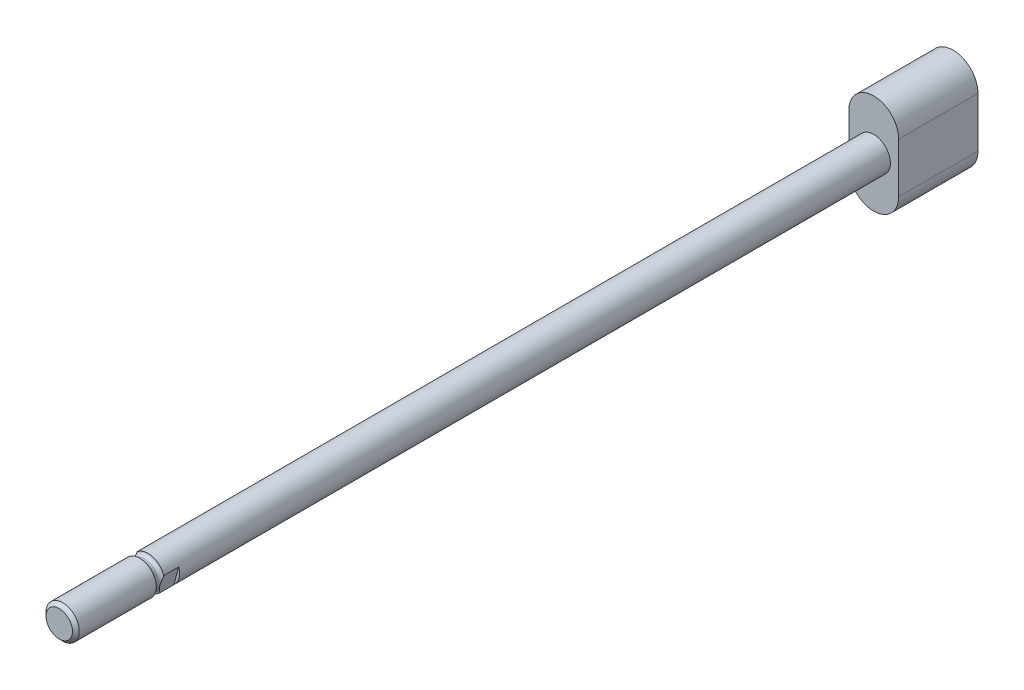
ISO-10303-21;
HEADER;
FILE_DESCRIPTION(('STEP AP214'),'2;1');
FILE_NAME('part.step','',(''),(''),'','','');
FILE_SCHEMA(('AUTOMOTIVE_DESIGN { 1 0 10303 214 1 1 1 1 }'));
ENDSEC;
DATA;
#1=APPLICATION_CONTEXT('core data for automotive mechanical design processes');
#2=APPLICATION_PROTOCOL_DEFINITION('international standard','automotive_design',2000,#1);
#3=PRODUCT_CONTEXT('',#1,'mechanical');
#4=PRODUCT('Part','Part','',(#3));
#5=PRODUCT_RELATED_PRODUCT_CATEGORY('part','',(#4));
#6=PRODUCT_DEFINITION_FORMATION('','',#4);
#7=PRODUCT_DEFINITION_CONTEXT('part definition',#1,'design');
#8=PRODUCT_DEFINITION('design','',#6,#7);
#9=PRODUCT_DEFINITION_SHAPE('','',#8);
#10=(LENGTH_UNIT() NAMED_UNIT(*) SI_UNIT(.MILLI.,.METRE.));
#11=(NAMED_UNIT(*) PLANE_ANGLE_UNIT() SI_UNIT($,.RADIAN.));
#12=(NAMED_UNIT(*) SI_UNIT($,.STERADIAN.) SOLID_ANGLE_UNIT());
#13=UNCERTAINTY_MEASURE_WITH_UNIT(LENGTH_MEASURE(1.E-05),#10,'distance_accuracy_value','');
#14=(GEOMETRIC_REPRESENTATION_CONTEXT(3) GLOBAL_UNCERTAINTY_ASSIGNED_CONTEXT((#13)) GLOBAL_UNIT_ASSIGNED_CONTEXT((#10,
#11,#12)) REPRESENTATION_CONTEXT('',''));
#15=CARTESIAN_POINT('',(0.,0.,0.));
#16=DIRECTION('',(0.,0.,1.));
#17=DIRECTION('',(1.,0.,0.));
#18=AXIS2_PLACEMENT_3D('',#15,#16,#17);
#19=CARTESIAN_POINT('',(0.,0.,6.5));
#20=DIRECTION('',(0.,0.,-1.));
#21=DIRECTION('',(-1.,0.,0.));
#22=AXIS2_PLACEMENT_3D('',#19,#20,#21);
#23=CYLINDRICAL_SURFACE('',#22,3.);
#24=CARTESIAN_POINT('',(0.,0.,-123.85));
#25=DIRECTION('',(0.,0.,1.));
#26=DIRECTION('',(1.,0.,0.));
#27=AXIS2_PLACEMENT_3D('',#24,#25,#26);
#28=CIRCLE('',#27,3.);
#29=CARTESIAN_POINT('',(3.,0.,-123.85));
#30=VERTEX_POINT('',#29);
#31=EDGE_CURVE('E11',#30,#30,#28,.F.);
#32=ORIENTED_EDGE('',*,*,#31,.F.);
#33=EDGE_LOOP('',(#32));
#34=FACE_BOUND('',#33,.T.);
#35=CARTESIAN_POINT('',(0.,0.,4.3));
#36=DIRECTION('',(0.,0.,1.));
#37=DIRECTION('',(1.,0.,0.));
#38=AXIS2_PLACEMENT_3D('',#35,#36,#37);
#39=CIRCLE('',#38,3.);
#40=CARTESIAN_POINT('',(-2.84401739632425,-0.954759157801097,4.3));
#41=VERTEX_POINT('',#40);
#42=CARTESIAN_POINT('',(-1.9856117351211,2.24885438331373,4.3));
#43=VERTEX_POINT('',#42);
#44=EDGE_CURVE('E50',#41,#43,#39,.F.);
#45=ORIENTED_EDGE('',*,*,#44,.T.);
#46=DIRECTION('',(0.,0.,-1.));
#47=VECTOR('',#46,1.);
#48=CARTESIAN_POINT('',(-1.9856117351211,2.24885438331373,6.5));
#49=LINE('',#48,#47);
#50=CARTESIAN_POINT('',(-1.98561173512109,2.24885438331375,6.99999999999974));
#51=VERTEX_POINT('',#50);
#52=EDGE_CURVE('E158',#43,#51,#49,.F.);
#53=ORIENTED_EDGE('',*,*,#52,.T.);
#54=CARTESIAN_POINT('',(0.,0.,7.));
#55=DIRECTION('',(0.,0.,-1.));
#56=DIRECTION('',(-1.,0.,0.));
#57=AXIS2_PLACEMENT_3D('',#54,#55,#56);
#58=CIRCLE('',#57,3.);
#59=CARTESIAN_POINT('',(2.84401739632423,0.954759157801142,7.));
#60=VERTEX_POINT('',#59);
#61=EDGE_CURVE('E181',#51,#60,#58,.T.);
#62=ORIENTED_EDGE('',*,*,#61,.T.);
#63=DIRECTION('',(0.,0.,-1.));
#64=VECTOR('',#63,1.);
#65=CARTESIAN_POINT('',(2.84401739632423,0.954759157801142,6.5));
#66=LINE('',#65,#64);
#67=CARTESIAN_POINT('',(2.84401739632423,0.954759157801142,4.3));
#68=VERTEX_POINT('',#67);
#69=EDGE_CURVE('E65',#60,#68,#66,.T.);
#70=ORIENTED_EDGE('',*,*,#69,.T.);
#71=CARTESIAN_POINT('',(1.98561173512111,-2.24885438331372,4.3));
#72=VERTEX_POINT('',#71);
#73=EDGE_CURVE('E248',#68,#72,#39,.F.);
#74=ORIENTED_EDGE('',*,*,#73,.T.);
#75=DIRECTION('',(0.,0.,-1.));
#76=VECTOR('',#75,1.);
#77=CARTESIAN_POINT('',(1.98561173512111,-2.24885438331372,6.5));
#78=LINE('',#77,#76);
#79=CARTESIAN_POINT('',(1.98561173512111,-2.24885438331374,6.99999999999974));
#80=VERTEX_POINT('',#79);
#81=EDGE_CURVE('E162',#72,#80,#78,.F.);
#82=ORIENTED_EDGE('',*,*,#81,.T.);
#83=CARTESIAN_POINT('',(-2.84401739632425,-0.954759157801097,7.));
#84=VERTEX_POINT('',#83);
#85=EDGE_CURVE('E180',#80,#84,#58,.T.);
#86=ORIENTED_EDGE('',*,*,#85,.T.);
#87=DIRECTION('',(0.,0.,-1.));
#88=VECTOR('',#87,1.);
#89=CARTESIAN_POINT('',(-2.84401739632425,-0.954759157801095,6.5));
#90=LINE('',#89,#88);
#91=EDGE_CURVE('E57',#84,#41,#90,.T.);
#92=ORIENTED_EDGE('',*,*,#91,.T.);
#93=EDGE_LOOP('',(#45,#53,#62,#70,#74,#82,#86,#92));
#94=FACE_BOUND('',#93,.T.);
#95=ADVANCED_FACE('F43',(#34,#94),#23,.T.);
#96=CARTESIAN_POINT('',(0.,0.,7.6000000000001));
#97=DIRECTION('',(0.,0.,-1.));
#98=DIRECTION('',(-1.,0.,0.));
#99=AXIS2_PLACEMENT_3D('',#96,#97,#98);
#100=TOROIDAL_SURFACE('',#99,3.0000000000001,0.600000000000099);
#101=CARTESIAN_POINT('',(0.,0.,7.6));
#102=DIRECTION('',(0.,0.,-1.));
#103=DIRECTION('',(-1.,0.,0.));
#104=AXIS2_PLACEMENT_3D('',#101,#102,#103);
#105=CIRCLE('',#104,2.4);
#106=CARTESIAN_POINT('',(-2.4,0.,7.6));
#107=VERTEX_POINT('',#106);
#108=EDGE_CURVE('E177',#107,#107,#105,.T.);
#109=ORIENTED_EDGE('',*,*,#108,.T.);
#110=EDGE_LOOP('',(#109));
#111=FACE_BOUND('',#110,.T.);
#112=ORIENTED_EDGE('',*,*,#85,.F.);
#113=CARTESIAN_POINT('',(1.78428928389336,-3.0002,7.2547069152957));
#114=CARTESIAN_POINT('',(1.78906861743825,-2.98236328438416,7.23639868329596));
#115=CARTESIAN_POINT('',(1.79413251615115,-2.96346455710323,7.21927102970705));
#116=CARTESIAN_POINT('',(1.80470423901084,-2.92401035026732,7.18733126765002));
#117=CARTESIAN_POINT('',(1.8102106230358,-2.9034602453202,7.17251207456602));
#118=CARTESIAN_POINT('',(1.82709895502079,-2.84043213229713,7.13166613512136));
#119=CARTESIAN_POINT('',(1.8389868639061,-2.79606585234141,7.10875658246275));
#120=CARTESIAN_POINT('',(1.86700003507435,-2.69151927426037,7.06483484183125));
#121=CARTESIAN_POINT('',(1.88336791191989,-2.63043352626078,7.04622090491631));
#122=CARTESIAN_POINT('',(1.91668678076934,-2.50608581486391,7.01871125794661));
#123=CARTESIAN_POINT('',(1.93364021499831,-2.4428147369586,7.00986309884397));
#124=CARTESIAN_POINT('',(1.96609809891719,-2.32168026506718,7.00044288032693));
#125=CARTESIAN_POINT('',(1.98159088358271,-2.26386040554471,6.99917848815538));
#126=CARTESIAN_POINT('',(2.0125568215942,-2.1482939515818,7.00180211925441));
#127=CARTESIAN_POINT('',(2.02802993340006,-2.09054751217113,7.00569592608855));
#128=CARTESIAN_POINT('',(2.05898855462406,-1.9750083648309,7.0175872569702));
#129=CARTESIAN_POINT('',(2.07447317901827,-1.91721895985558,7.02561725698419));
#130=CARTESIAN_POINT('',(2.10529478327747,-1.80219116678946,7.04477779010399));
#131=CARTESIAN_POINT('',(2.12063188303649,-1.74495233124807,7.05590553775458));
#132=CARTESIAN_POINT('',(2.15009821499025,-1.63498248328393,7.07942972049004));
#133=CARTESIAN_POINT('',(2.16423553666569,-1.58222128050823,7.0916789462632));
#134=CARTESIAN_POINT('',(2.19244778806578,-1.47693172488718,7.11722145202707));
#135=CARTESIAN_POINT('',(2.20652270783706,-1.42440340918834,7.13051489266332));
#136=CARTESIAN_POINT('',(2.23468365865931,-1.31930530993022,7.15724864827218));
#137=CARTESIAN_POINT('',(2.24876967794869,-1.26673557026587,7.17068914176345));
#138=CARTESIAN_POINT('',(2.27701024290482,-1.16134034701515,7.19656818876434));
#139=CARTESIAN_POINT('',(2.29116480938259,-1.108514785761,7.20900641475076));
#140=CARTESIAN_POINT('',(2.3193653234073,-1.00326903462121,7.23122524619684));
#141=CARTESIAN_POINT('',(2.33340894290738,-0.950857533124738,7.24104793485401));
#142=CARTESIAN_POINT('',(2.36164303548091,-0.84548646513474,7.25666970996551));
#143=CARTESIAN_POINT('',(2.37583336771721,-0.792527424252576,7.26247234663752));
#144=CARTESIAN_POINT('',(2.40424001913043,-0.686512357905542,7.26871086347242));
#145=CARTESIAN_POINT('',(2.4184559815362,-0.633457663928724,7.26916908288715));
#146=CARTESIAN_POINT('',(2.44683354504169,-0.527551155131197,7.26465345979322));
#147=CARTESIAN_POINT('',(2.46099510857075,-0.474699480526146,7.25967637035201));
#148=CARTESIAN_POINT('',(2.48739818541467,-0.3761618562685,7.24636709096959));
#149=CARTESIAN_POINT('',(2.49965782936129,-0.330408242177005,7.2385337573574));
#150=CARTESIAN_POINT('',(2.52406800176128,-0.239308238558716,7.22070567389674));
#151=CARTESIAN_POINT('',(2.53621852717457,-0.193961860377656,7.21071086402217));
#152=CARTESIAN_POINT('',(2.56050923976332,-0.103307686844385,7.18949400632838));
#153=CARTESIAN_POINT('',(2.57264907231151,-0.0580012149791535,7.17826607926568));
#154=CARTESIAN_POINT('',(2.5969056586589,0.0325255976874803,7.15544014274893));
#155=CARTESIAN_POINT('',(2.6090224108104,0.0777459323395919,7.14384210785039));
#156=CARTESIAN_POINT('',(2.64582554712007,0.215097106925173,7.10911815387095));
#157=CARTESIAN_POINT('',(2.67054444156685,0.307349276907487,7.08648227751513));
#158=CARTESIAN_POINT('',(2.72025529113799,0.492872693194391,7.0470486332687));
#159=CARTESIAN_POINT('',(2.74524636340561,0.586140644632787,7.03023575678776));
#160=CARTESIAN_POINT('',(2.78130197319363,0.720702012259566,7.01323872854939));
#161=CARTESIAN_POINT('',(2.79223656212369,0.761510453706438,7.009029885666));
#162=CARTESIAN_POINT('',(2.81415047339667,0.84329428396974,7.00285204263986));
#163=CARTESIAN_POINT('',(2.82512980999665,0.884269725994254,7.00088382332145));
#164=CARTESIAN_POINT('',(2.85794561003269,1.00673995901979,6.99894375438474));
#165=CARTESIAN_POINT('',(2.87981910718841,1.08837296174415,7.00285056611947));
#166=CARTESIAN_POINT('',(2.91849922075284,1.23272911080915,7.02250369852203));
#167=CARTESIAN_POINT('',(2.93538949848092,1.29576448544427,7.03554081025875));
#168=CARTESIAN_POINT('',(2.96019799488484,1.38835105448312,7.06345946956806));
#169=CARTESIAN_POINT('',(2.9684238706186,1.41905044065824,7.07424318243855));
#170=CARTESIAN_POINT('',(2.98457390926757,1.47932320544041,7.09898773527071));
#171=CARTESIAN_POINT('',(2.99249714702534,1.50889313131285,7.1129575286994));
#172=CARTESIAN_POINT('',(3.0002,1.53764056997752,7.12867199246494));
#173=B_SPLINE_CURVE_WITH_KNOTS('',3,(#113,#114,#115,#116,#117,#118,#119,#120,#121,#122,#123,
#124,#125,#126,#127,#128,#129,#130,#131,#132,#133,#134,#135,#136,#137,#138,#139,#140,#141,#142,
#143,#144,#145,#146,#147,#148,#149,#150,#151,#152,#153,#154,#155,#156,#157,#158,#159,#160,#161,
#162,#163,#164,#165,#166,#167,#168,#169,#170,#171,#172),.UNSPECIFIED.,.F.,.F.,(4,2,2,2,2,2,2,2,
2,2,2,2,2,2,2,2,2,2,2,2,2,2,2,2,2,2,2,2,2,4),(0.,0.0778831402477305,0.155522338474484,
0.308670922530255,0.50543277995489,0.703148528985292,0.882501065774774,1.06205486956866,
1.24304045813448,1.42386382952087,1.59178298003943,1.75972801459498,1.92790656547544,
2.09613985310081,2.26147561567191,2.42666517894951,2.59116401392538,2.75576117062527,
2.89972280701112,3.04368844185216,3.18837300124491,3.33306752906019,3.62748955875383,
3.92114184337195,4.04845767494625,4.17581786064581,4.4286846648712,4.62750090273336,
4.72803228730687,4.82884974252454),.UNSPECIFIED.);
#174=EDGE_CURVE('E191',#80,#60,#173,.T.);
#175=ORIENTED_EDGE('',*,*,#174,.T.);
#176=ORIENTED_EDGE('',*,*,#61,.F.);
#177=CARTESIAN_POINT('',(-1.78428928389338,3.00019999999986,7.25470691529554));
#178=CARTESIAN_POINT('',(-1.78906861743827,2.98236328438402,7.23639868329581));
#179=CARTESIAN_POINT('',(-1.79413251615117,2.96346455710308,7.21927102970691));
#180=CARTESIAN_POINT('',(-1.80470423901086,2.92401035026717,7.18733126764989));
#181=CARTESIAN_POINT('',(-1.81021062303582,2.90346024532004,7.1725120745659));
#182=CARTESIAN_POINT('',(-1.82709895502081,2.84043213229696,7.13166613512125));
#183=CARTESIAN_POINT('',(-1.83898686390612,2.79606585234124,7.10875658246266));
#184=CARTESIAN_POINT('',(-1.86700003507439,2.69151927426017,7.06483484183118));
#185=CARTESIAN_POINT('',(-1.88336791191993,2.63043352626055,7.04622090491625));
#186=CARTESIAN_POINT('',(-1.9166867807694,2.50608581486364,7.01871125794656));
#187=CARTESIAN_POINT('',(-1.93364021499838,2.44281473695831,7.00986309884393));
#188=CARTESIAN_POINT('',(-1.96609809891727,2.32168026506683,7.00044288032692));
#189=CARTESIAN_POINT('',(-1.9815908835828,2.26386040554433,6.99917848815537));
#190=CARTESIAN_POINT('',(-2.01255682159431,2.14829395158135,7.00180211925443));
#191=CARTESIAN_POINT('',(-2.02802993340018,2.09054751217066,7.00569592608859));
#192=CARTESIAN_POINT('',(-2.05898855462419,1.97500836483037,7.01758725697027));
#193=CARTESIAN_POINT('',(-2.07447317901842,1.91721895985501,7.02561725698427));
#194=CARTESIAN_POINT('',(-2.10529478327763,1.80219116678884,7.04477779010411));
#195=CARTESIAN_POINT('',(-2.12063188303666,1.74495233124741,7.05590553775471));
#196=CARTESIAN_POINT('',(-2.15009821499043,1.63498248328324,7.0794297204902));
#197=CARTESIAN_POINT('',(-2.16423553666588,1.58222128050753,7.09167894626337));
#198=CARTESIAN_POINT('',(-2.19244778806598,1.47693172488646,7.11722145202725));
#199=CARTESIAN_POINT('',(-2.20652270783725,1.4244034091876,7.13051489266351));
#200=CARTESIAN_POINT('',(-2.23468365865952,1.31930530992946,7.15724864827237));
#201=CARTESIAN_POINT('',(-2.2487696779489,1.2667355702651,7.17068914176365));
#202=CARTESIAN_POINT('',(-2.27701024290503,1.16134034701436,7.19656818876453));
#203=CARTESIAN_POINT('',(-2.29116480938281,1.10851478576019,7.20900641475094));
#204=CARTESIAN_POINT('',(-2.31936532340753,1.00326903462038,7.231225246197));
#205=CARTESIAN_POINT('',(-2.33340894290761,0.950857533123894,7.24104793485415));
#206=CARTESIAN_POINT('',(-2.36164303548115,0.845486465133866,7.25666970996561));
#207=CARTESIAN_POINT('',(-2.37583336771745,0.792527424251688,7.26247234663759));
#208=CARTESIAN_POINT('',(-2.40424001913068,0.686512357904626,7.26871086347243));
#209=CARTESIAN_POINT('',(-2.41845598153645,0.633457663927794,7.26916908288713));
#210=CARTESIAN_POINT('',(-2.44683354504196,0.527551155130243,7.26465345979313));
#211=CARTESIAN_POINT('',(-2.46099510857102,0.474699480525181,7.25967637035189));
#212=CARTESIAN_POINT('',(-2.48739818541492,0.376161856267579,7.24636709096943));
#213=CARTESIAN_POINT('',(-2.49965782936153,0.330408242176138,7.23853375735723));
#214=CARTESIAN_POINT('',(-2.5240680017615,0.239308238557956,7.22070567389656));
#215=CARTESIAN_POINT('',(-2.53621852717477,0.193961860376949,7.210710864022));
#216=CARTESIAN_POINT('',(-2.5605092397635,0.103307686843784,7.18949400632822));
#217=CARTESIAN_POINT('',(-2.57264907231167,0.0580012149786046,7.17826607926553));
#218=CARTESIAN_POINT('',(-2.59690565865904,-0.032525597687924,7.15544014274881));
#219=CARTESIAN_POINT('',(-2.60902241081052,-0.0777459323399832,7.14384210785028));
#220=CARTESIAN_POINT('',(-2.64582554712015,-0.215097106925404,7.10911815387088));
#221=CARTESIAN_POINT('',(-2.6705444415669,-0.30734927690761,7.08648227751509));
#222=CARTESIAN_POINT('',(-2.72025529113798,-0.492872693194296,7.04704863326872));
#223=CARTESIAN_POINT('',(-2.74524636340558,-0.586140644632584,7.03023575678779));
#224=CARTESIAN_POINT('',(-2.78130197319358,-0.720702012259261,7.01323872854942));
#225=CARTESIAN_POINT('',(-2.79223656212364,-0.761510453706141,7.00902988566602));
#226=CARTESIAN_POINT('',(-2.81415047339662,-0.843294283969462,7.00285204263987));
#227=CARTESIAN_POINT('',(-2.8251298099966,-0.884269725993984,7.00088382332146));
#228=CARTESIAN_POINT('',(-2.85794561003265,-1.00673995901954,6.99894375438474));
#229=CARTESIAN_POINT('',(-2.87981910718838,-1.08837296174393,7.00285056611946));
#230=CARTESIAN_POINT('',(-2.91849922075282,-1.23272911080896,7.022503698522));
#231=CARTESIAN_POINT('',(-2.9353894984809,-1.29576448544409,7.03554081025871));
#232=CARTESIAN_POINT('',(-2.96019799488483,-1.38835105448297,7.06345946956802));
#233=CARTESIAN_POINT('',(-2.96842387061859,-1.41905044065809,7.07424318243851));
#234=CARTESIAN_POINT('',(-2.98457390926757,-1.47932320544028,7.09898773527067));
#235=CARTESIAN_POINT('',(-2.99249714702534,-1.50889313131272,7.11295752869935));
#236=CARTESIAN_POINT('',(-3.0002,-1.5376405699774,7.1286719924649));
#237=B_SPLINE_CURVE_WITH_KNOTS('',3,(#177,#178,#179,#180,#181,#182,#183,#184,#185,#186,#187,
#188,#189,#190,#191,#192,#193,#194,#195,#196,#197,#198,#199,#200,#201,#202,#203,#204,#205,#206,
#207,#208,#209,#210,#211,#212,#213,#214,#215,#216,#217,#218,#219,#220,#221,#222,#223,#224,#225,
#226,#227,#228,#229,#230,#231,#232,#233,#234,#235,#236),.UNSPECIFIED.,.F.,.F.,(4,2,2,2,2,2,2,2,
2,2,2,2,2,2,2,2,2,2,2,2,2,2,2,2,2,2,2,2,2,4),(0.,0.0778831402477294,0.155522338474481,
0.308670922530249,0.505432779954952,0.703148528985421,0.882501065775001,1.06205486956898,
1.2430404581349,1.4238638295214,1.59178298003999,1.75972801459557,1.92790656547607,
2.09613985310148,2.26147561567261,2.42666517895024,2.59116401392616,2.75576117062609,
2.89972280701178,3.04368844185266,3.18837300124524,3.33306752906036,3.62748955875365,
3.92114184337143,4.04845767494576,4.17581786064534,4.4286846648708,4.62750090273299,
4.72803228730652,4.8288497425242),.UNSPECIFIED.);
#238=EDGE_CURVE('E184',#51,#84,#237,.T.);
#239=ORIENTED_EDGE('',*,*,#238,.T.);
#240=EDGE_LOOP('',(#112,#175,#176,#239));
#241=FACE_BOUND('',#240,.T.);
#242=ADVANCED_FACE('F197',(#111,#241),#100,.F.);
#243=CARTESIAN_POINT('',(0.,0.,6.5));
#244=DIRECTION('',(0.,0.,-1.));
#245=DIRECTION('',(-1.,0.,0.));
#246=AXIS2_PLACEMENT_3D('',#243,#244,#245);
#247=CYLINDRICAL_SURFACE('',#246,2.4);
#248=CARTESIAN_POINT('',(0.,0.,7.9));
#249=DIRECTION('',(0.,0.,-1.));
#250=DIRECTION('',(-1.,0.,0.));
#251=AXIS2_PLACEMENT_3D('',#248,#249,#250);
#252=CIRCLE('',#251,2.4);
#253=CARTESIAN_POINT('',(-2.4,0.,7.9));
#254=VERTEX_POINT('',#253);
#255=EDGE_CURVE('E174',#254,#254,#252,.T.);
#256=ORIENTED_EDGE('',*,*,#255,.T.);
#257=EDGE_LOOP('',(#256));
#258=FACE_BOUND('',#257,.T.);
#259=ORIENTED_EDGE('',*,*,#108,.F.);
#260=EDGE_LOOP('',(#259));
#261=FACE_BOUND('',#260,.T.);
#262=ADVANCED_FACE('F229',(#258,#261),#247,.T.);
#263=CARTESIAN_POINT('',(0.,0.,7.8999999999999));
#264=DIRECTION('',(0.,0.,-1.));
#265=DIRECTION('',(-1.,0.,0.));
#266=AXIS2_PLACEMENT_3D('',#263,#264,#265);
#267=TOROIDAL_SURFACE('',#266,3.0000000000001,0.6000000000001);
#268=CARTESIAN_POINT('',(0.,0.,8.5));
#269=DIRECTION('',(0.,0.,-1.));
#270=DIRECTION('',(-1.,0.,0.));
#271=AXIS2_PLACEMENT_3D('',#268,#269,#270);
#272=CIRCLE('',#271,3.);
#273=CARTESIAN_POINT('',(-3.,0.,8.5));
#274=VERTEX_POINT('',#273);
#275=EDGE_CURVE('E171',#274,#274,#272,.T.);
#276=ORIENTED_EDGE('',*,*,#275,.T.);
#277=EDGE_LOOP('',(#276));
#278=FACE_BOUND('',#277,.T.);
#279=ORIENTED_EDGE('',*,*,#255,.F.);
#280=EDGE_LOOP('',(#279));
#281=FACE_BOUND('',#280,.T.);
#282=ADVANCED_FACE('F226',(#278,#281),#267,.F.);
#283=CARTESIAN_POINT('',(0.,0.,6.5));
#284=DIRECTION('',(0.,0.,-1.));
#285=DIRECTION('',(-1.,0.,0.));
#286=AXIS2_PLACEMENT_3D('',#283,#284,#285);
#287=CYLINDRICAL_SURFACE('',#286,3.);
#288=CARTESIAN_POINT('',(0.,0.,22.3865));
#289=DIRECTION('',(0.,0.,-1.));
#290=DIRECTION('',(-1.,0.,0.));
#291=AXIS2_PLACEMENT_3D('',#288,#289,#290);
#292=CIRCLE('',#291,3.);
#293=CARTESIAN_POINT('',(-3.,0.,22.3865));
#294=VERTEX_POINT('',#293);
#295=EDGE_CURVE('E168',#294,#294,#292,.T.);
#296=ORIENTED_EDGE('',*,*,#295,.T.);
#297=EDGE_LOOP('',(#296));
#298=FACE_BOUND('',#297,.T.);
#299=ORIENTED_EDGE('',*,*,#275,.F.);
#300=EDGE_LOOP('',(#299));
#301=FACE_BOUND('',#300,.T.);
#302=ADVANCED_FACE('F222',(#298,#301),#287,.T.);
#303=CARTESIAN_POINT('',(0.,0.,22.3865));
#304=DIRECTION('',(0.,0.,-1.));
#305=DIRECTION('',(-1.,0.,0.));
#306=AXIS2_PLACEMENT_3D('',#303,#304,#305);
#307=CONICAL_SURFACE('',#306,3.,0.785398163397452);
#308=CARTESIAN_POINT('',(0.,0.,23.));
#309=DIRECTION('',(0.,0.,-1.));
#310=DIRECTION('',(-1.,0.,0.));
#311=AXIS2_PLACEMENT_3D('',#308,#309,#310);
#312=CIRCLE('',#311,2.3865);
#313=CARTESIAN_POINT('',(-2.3865,0.,23.));
#314=VERTEX_POINT('',#313);
#315=EDGE_CURVE('E165',#314,#314,#312,.T.);
#316=ORIENTED_EDGE('',*,*,#315,.T.);
#317=EDGE_LOOP('',(#316));
#318=FACE_BOUND('',#317,.T.);
#319=ORIENTED_EDGE('',*,*,#295,.F.);
#320=EDGE_LOOP('',(#319));
#321=FACE_BOUND('',#320,.T.);
#322=ADVANCED_FACE('F218',(#318,#321),#307,.T.);
#323=CARTESIAN_POINT('',(0.,0.,23.));
#324=DIRECTION('',(0.,0.,1.));
#325=DIRECTION('',(1.,0.,0.));
#326=AXIS2_PLACEMENT_3D('',#323,#324,#325);
#327=PLANE('',#326);
#328=ORIENTED_EDGE('',*,*,#315,.F.);
#329=EDGE_LOOP('',(#328));
#330=FACE_BOUND('',#329,.T.);
#331=ADVANCED_FACE('F205',(#330),#327,.T.);
#332=CARTESIAN_POINT('',(-3.7089097912353,-4.182581518689,7.6));
#333=DIRECTION('',(-0.965925826289067,0.258819045102527,0.));
#334=DIRECTION('',(-0.258819045102527,-0.965925826289067,0.));
#335=AXIS2_PLACEMENT_3D('',#332,#333,#334);
#336=PLANE('',#335);
#337=DIRECTION('',(0.258819045102527,0.965925826289067,0.));
#338=VECTOR('',#337,1.);
#339=CARTESIAN_POINT('',(-3.7089097912353,-4.182581518689,4.3));
#340=LINE('',#339,#338);
#341=EDGE_CURVE('E154',#41,#43,#340,.T.);
#342=ORIENTED_EDGE('',*,*,#341,.F.);
#343=ORIENTED_EDGE('',*,*,#91,.F.);
#344=ORIENTED_EDGE('',*,*,#238,.F.);
#345=ORIENTED_EDGE('',*,*,#52,.F.);
#346=EDGE_LOOP('',(#342,#343,#344,#345));
#347=FACE_BOUND('',#346,.T.);
#348=ADVANCED_FACE('F200',(#347),#336,.T.);
#349=CARTESIAN_POINT('',(0.,0.,4.3));
#350=DIRECTION('',(0.,0.,1.));
#351=DIRECTION('',(1.,0.,0.));
#352=AXIS2_PLACEMENT_3D('',#349,#350,#351);
#353=PLANE('',#352);
#354=ORIENTED_EDGE('',*,*,#341,.T.);
#355=ORIENTED_EDGE('',*,*,#44,.F.);
#356=EDGE_LOOP('',(#354,#355));
#357=FACE_BOUND('',#356,.T.);
#358=ADVANCED_FACE('F204',(#357),#353,.T.);
#359=CARTESIAN_POINT('',(3.3853859848571,2.9751742358277,7.6));
#360=DIRECTION('',(0.965925826289069,-0.258819045102516,0.));
#361=DIRECTION('',(0.258819045102516,0.96592582628907,0.));
#362=AXIS2_PLACEMENT_3D('',#359,#360,#361);
#363=PLANE('',#362);
#364=DIRECTION('',(-0.258819045102516,-0.965925826289069,0.));
#365=VECTOR('',#364,1.);
#366=CARTESIAN_POINT('',(3.3853859848571,2.9751742358277,4.3));
#367=LINE('',#366,#365);
#368=EDGE_CURVE('E128',#68,#72,#367,.T.);
#369=ORIENTED_EDGE('',*,*,#368,.F.);
#370=ORIENTED_EDGE('',*,*,#69,.F.);
#371=ORIENTED_EDGE('',*,*,#174,.F.);
#372=ORIENTED_EDGE('',*,*,#81,.F.);
#373=EDGE_LOOP('',(#369,#370,#371,#372));
#374=FACE_BOUND('',#373,.T.);
#375=ADVANCED_FACE('F208',(#374),#363,.T.);
#376=ORIENTED_EDGE('',*,*,#368,.T.);
#377=ORIENTED_EDGE('',*,*,#73,.F.);
#378=EDGE_LOOP('',(#376,#377));
#379=FACE_BOUND('',#378,.T.);
#380=ADVANCED_FACE('F206',(#379),#353,.T.);
#381=CARTESIAN_POINT('',(-1.196959198424E-13,-4.50000000000012,-123.85));
#382=DIRECTION('',(0.,0.,-1.));
#383=DIRECTION('',(-1.,0.,0.));
#384=AXIS2_PLACEMENT_3D('',#381,#382,#383);
#385=CYLINDRICAL_SURFACE('',#384,4.5);
#386=CARTESIAN_POINT('',(-1.196959198424E-13,-4.50000000000012,-138.15));
#387=DIRECTION('',(0.,0.,1.));
#388=DIRECTION('',(1.,0.,0.));
#389=AXIS2_PLACEMENT_3D('',#386,#387,#388);
#390=CIRCLE('',#389,4.5);
#391=CARTESIAN_POINT('',(-4.5,-4.5,-138.15));
#392=VERTEX_POINT('',#391);
#393=CARTESIAN_POINT('',(4.5,-4.5,-138.15));
#394=VERTEX_POINT('',#393);
#395=EDGE_CURVE('E124',#392,#394,#390,.T.);
#396=ORIENTED_EDGE('',*,*,#395,.T.);
#397=DIRECTION('',(0.,0.,-1.));
#398=VECTOR('',#397,1.);
#399=CARTESIAN_POINT('',(4.5,-4.5,-123.85));
#400=LINE('',#399,#398);
#401=CARTESIAN_POINT('',(4.5,-4.5,-123.85));
#402=VERTEX_POINT('',#401);
#403=EDGE_CURVE('E122',#402,#394,#400,.T.);
#404=ORIENTED_EDGE('',*,*,#403,.F.);
#405=CARTESIAN_POINT('',(-1.196959198424E-13,-4.50000000000012,-123.85));
#406=DIRECTION('',(0.,0.,1.));
#407=DIRECTION('',(1.,0.,0.));
#408=AXIS2_PLACEMENT_3D('',#405,#406,#407);
#409=CIRCLE('',#408,4.49999999999988);
#410=CARTESIAN_POINT('',(-4.5,-4.5,-123.85));
#411=VERTEX_POINT('',#410);
#412=EDGE_CURVE('E108',#411,#402,#409,.T.);
#413=ORIENTED_EDGE('',*,*,#412,.F.);
#414=DIRECTION('',(0.,0.,-1.));
#415=VECTOR('',#414,1.);
#416=CARTESIAN_POINT('',(-4.5,-4.5,-123.85));
#417=LINE('',#416,#415);
#418=EDGE_CURVE('E139',#411,#392,#417,.T.);
#419=ORIENTED_EDGE('',*,*,#418,.T.);
#420=EDGE_LOOP('',(#396,#404,#413,#419));
#421=FACE_BOUND('',#420,.T.);
#422=ADVANCED_FACE('F123',(#421),#385,.T.);
#423=CARTESIAN_POINT('',(4.5,-4.5,-123.85));
#424=DIRECTION('',(-1.,0.,0.));
#425=DIRECTION('',(0.,0.,1.));
#426=AXIS2_PLACEMENT_3D('',#423,#424,#425);
#427=PLANE('',#426);
#428=DIRECTION('',(0.,1.,0.));
#429=VECTOR('',#428,1.);
#430=CARTESIAN_POINT('',(4.5,-4.5,-138.15));
#431=LINE('',#430,#429);
#432=CARTESIAN_POINT('',(4.5,4.5,-138.15));
#433=VERTEX_POINT('',#432);
#434=EDGE_CURVE('E141',#394,#433,#431,.T.);
#435=ORIENTED_EDGE('',*,*,#434,.T.);
#436=DIRECTION('',(0.,0.,-1.));
#437=VECTOR('',#436,1.);
#438=CARTESIAN_POINT('',(4.5,4.5,-123.85));
#439=LINE('',#438,#437);
#440=CARTESIAN_POINT('',(4.5,4.5,-123.85));
#441=VERTEX_POINT('',#440);
#442=EDGE_CURVE('E129',#441,#433,#439,.T.);
#443=ORIENTED_EDGE('',*,*,#442,.F.);
#444=DIRECTION('',(0.,1.,0.));
#445=VECTOR('',#444,1.);
#446=CARTESIAN_POINT('',(4.5,-4.5,-123.85));
#447=LINE('',#446,#445);
#448=EDGE_CURVE('E112',#402,#441,#447,.T.);
#449=ORIENTED_EDGE('',*,*,#448,.F.);
#450=ORIENTED_EDGE('',*,*,#403,.T.);
#451=EDGE_LOOP('',(#435,#443,#449,#450));
#452=FACE_BOUND('',#451,.T.);
#453=ADVANCED_FACE('F131',(#452),#427,.F.);
#454=CARTESIAN_POINT('',(1.196959198424E-13,4.50000000000012,-123.85));
#455=DIRECTION('',(0.,0.,-1.));
#456=DIRECTION('',(-1.,0.,0.));
#457=AXIS2_PLACEMENT_3D('',#454,#455,#456);
#458=CYLINDRICAL_SURFACE('',#457,4.5);
#459=CARTESIAN_POINT('',(1.196959198424E-13,4.50000000000012,-138.15));
#460=DIRECTION('',(0.,0.,1.));
#461=DIRECTION('',(1.,0.,0.));
#462=AXIS2_PLACEMENT_3D('',#459,#460,#461);
#463=CIRCLE('',#462,4.5);
#464=CARTESIAN_POINT('',(-4.5,4.5,-138.15));
#465=VERTEX_POINT('',#464);
#466=EDGE_CURVE('E143',#433,#465,#463,.T.);
#467=ORIENTED_EDGE('',*,*,#466,.T.);
#468=DIRECTION('',(0.,0.,-1.));
#469=VECTOR('',#468,1.);
#470=CARTESIAN_POINT('',(-4.5,4.5,-123.85));
#471=LINE('',#470,#469);
#472=CARTESIAN_POINT('',(-4.5,4.5,-123.85));
#473=VERTEX_POINT('',#472);
#474=EDGE_CURVE('E148',#473,#465,#471,.T.);
#475=ORIENTED_EDGE('',*,*,#474,.F.);
#476=CARTESIAN_POINT('',(1.196959198424E-13,4.50000000000012,-123.85));
#477=DIRECTION('',(0.,0.,1.));
#478=DIRECTION('',(1.,0.,0.));
#479=AXIS2_PLACEMENT_3D('',#476,#477,#478);
#480=CIRCLE('',#479,4.49999999999988);
#481=EDGE_CURVE('E134',#441,#473,#480,.T.);
#482=ORIENTED_EDGE('',*,*,#481,.F.);
#483=ORIENTED_EDGE('',*,*,#442,.T.);
#484=EDGE_LOOP('',(#467,#475,#482,#483));
#485=FACE_BOUND('',#484,.T.);
#486=ADVANCED_FACE('F301',(#485),#458,.T.);
#487=CARTESIAN_POINT('',(-4.5,4.5,-123.85));
#488=DIRECTION('',(1.,0.,0.));
#489=DIRECTION('',(0.,0.,-1.));
#490=AXIS2_PLACEMENT_3D('',#487,#488,#489);
#491=PLANE('',#490);
#492=DIRECTION('',(0.,-1.,0.));
#493=VECTOR('',#492,1.);
#494=CARTESIAN_POINT('',(-4.5,4.5,-138.15));
#495=LINE('',#494,#493);
#496=EDGE_CURVE('E119',#465,#392,#495,.T.);
#497=ORIENTED_EDGE('',*,*,#496,.T.);
#498=ORIENTED_EDGE('',*,*,#418,.F.);
#499=DIRECTION('',(0.,-1.,0.));
#500=VECTOR('',#499,1.);
#501=CARTESIAN_POINT('',(-4.5,4.5,-123.85));
#502=LINE('',#501,#500);
#503=EDGE_CURVE('E115',#473,#411,#502,.T.);
#504=ORIENTED_EDGE('',*,*,#503,.F.);
#505=ORIENTED_EDGE('',*,*,#474,.T.);
#506=EDGE_LOOP('',(#497,#498,#504,#505));
#507=FACE_BOUND('',#506,.T.);
#508=ADVANCED_FACE('F312',(#507),#491,.F.);
#509=CARTESIAN_POINT('',(-1.196959198424E-13,-4.50000000000012,-123.85));
#510=DIRECTION('',(0.,0.,1.));
#511=DIRECTION('',(1.,0.,0.));
#512=AXIS2_PLACEMENT_3D('',#509,#510,#511);
#513=PLANE('',#512);
#514=ORIENTED_EDGE('',*,*,#31,.T.);
#515=EDGE_LOOP('',(#514));
#516=FACE_BOUND('',#515,.T.);
#517=ORIENTED_EDGE('',*,*,#412,.T.);
#518=ORIENTED_EDGE('',*,*,#448,.T.);
#519=ORIENTED_EDGE('',*,*,#481,.T.);
#520=ORIENTED_EDGE('',*,*,#503,.T.);
#521=EDGE_LOOP('',(#517,#518,#519,#520));
#522=FACE_BOUND('',#521,.T.);
#523=ADVANCED_FACE('F110',(#516,#522),#513,.T.);
#524=CARTESIAN_POINT('',(0.,3.,-138.15));
#525=DIRECTION('',(0.,0.,-1.));
#526=DIRECTION('',(-1.,0.,0.));
#527=AXIS2_PLACEMENT_3D('',#524,#525,#526);
#528=PLANE('',#527);
#529=ORIENTED_EDGE('',*,*,#395,.F.);
#530=ORIENTED_EDGE('',*,*,#496,.F.);
#531=ORIENTED_EDGE('',*,*,#466,.F.);
#532=ORIENTED_EDGE('',*,*,#434,.F.);
#533=EDGE_LOOP('',(#529,#530,#531,#532));
#534=FACE_BOUND('',#533,.T.);
#535=ADVANCED_FACE('F212',(#534),#528,.T.);
#536=CLOSED_SHELL('',(#95,#242,#262,#282,#302,#322,#331,#348,#358,#375,#380,#422,#453,#486,#508,
#523,#535));
#537=MANIFOLD_SOLID_BREP('B2',#536);
#538=ADVANCED_BREP_SHAPE_REPRESENTATION('',(#18,#537),#14);
#539=SHAPE_DEFINITION_REPRESENTATION(#9,#538);
ENDSEC;
END-ISO-10303-21;
